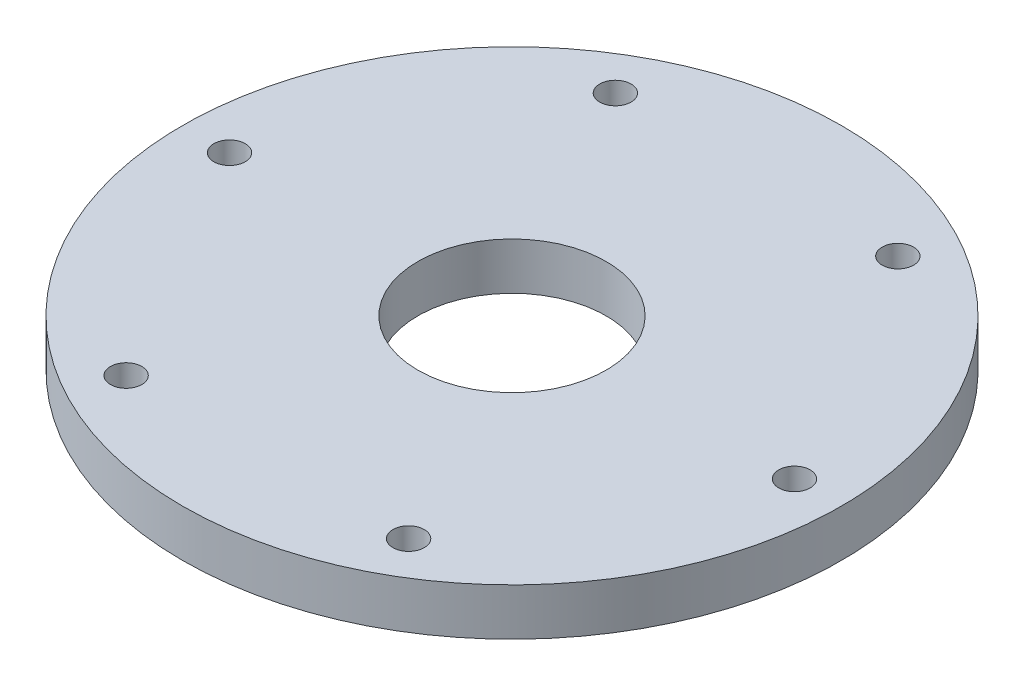
ISO-10303-21;
HEADER;
FILE_DESCRIPTION(('STEP AP214'),'2;1');
FILE_NAME('part.step','',(''),(''),'','','');
FILE_SCHEMA(('AUTOMOTIVE_DESIGN { 1 0 10303 214 1 1 1 1 }'));
ENDSEC;
DATA;
#1=APPLICATION_CONTEXT('core data for automotive mechanical design processes');
#2=APPLICATION_PROTOCOL_DEFINITION('international standard','automotive_design',2000,#1);
#3=PRODUCT_CONTEXT('',#1,'mechanical');
#4=PRODUCT('Part','Part','',(#3));
#5=PRODUCT_RELATED_PRODUCT_CATEGORY('part','',(#4));
#6=PRODUCT_DEFINITION_FORMATION('','',#4);
#7=PRODUCT_DEFINITION_CONTEXT('part definition',#1,'design');
#8=PRODUCT_DEFINITION('design','',#6,#7);
#9=PRODUCT_DEFINITION_SHAPE('','',#8);
#10=(LENGTH_UNIT() NAMED_UNIT(*) SI_UNIT(.MILLI.,.METRE.));
#11=(NAMED_UNIT(*) PLANE_ANGLE_UNIT() SI_UNIT($,.RADIAN.));
#12=(NAMED_UNIT(*) SI_UNIT($,.STERADIAN.) SOLID_ANGLE_UNIT());
#13=UNCERTAINTY_MEASURE_WITH_UNIT(LENGTH_MEASURE(1.E-05),#10,'distance_accuracy_value','');
#14=(GEOMETRIC_REPRESENTATION_CONTEXT(3) GLOBAL_UNCERTAINTY_ASSIGNED_CONTEXT((#13)) GLOBAL_UNIT_ASSIGNED_CONTEXT((#10,
#11,#12)) REPRESENTATION_CONTEXT('',''));
#15=CARTESIAN_POINT('',(0.,0.,0.));
#16=DIRECTION('',(0.,0.,1.));
#17=DIRECTION('',(1.,0.,0.));
#18=AXIS2_PLACEMENT_3D('',#15,#16,#17);
#19=CARTESIAN_POINT('',(0.,0.,0.));
#20=DIRECTION('',(0.,1.,0.));
#21=DIRECTION('',(0.,0.,1.));
#22=AXIS2_PLACEMENT_3D('',#19,#20,#21);
#23=PLANE('',#22);
#24=CARTESIAN_POINT('',(0.,0.,0.));
#25=DIRECTION('',(0.,-1.,0.));
#26=DIRECTION('',(0.,0.,-1.));
#27=AXIS2_PLACEMENT_3D('',#24,#25,#26);
#28=CIRCLE('',#27,41.275);
#29=CARTESIAN_POINT('',(0.,0.,-41.275));
#30=VERTEX_POINT('',#29);
#31=EDGE_CURVE('E73',#30,#30,#28,.T.);
#32=ORIENTED_EDGE('',*,*,#31,.T.);
#33=EDGE_LOOP('',(#32));
#34=FACE_BOUND('',#33,.T.);
#35=CARTESIAN_POINT('',(0.,0.,0.));
#36=DIRECTION('',(0.,1.,0.));
#37=DIRECTION('',(0.,0.,1.));
#38=AXIS2_PLACEMENT_3D('',#35,#36,#37);
#39=CIRCLE('',#38,19.05);
#40=CARTESIAN_POINT('',(0.,0.,19.05));
#41=VERTEX_POINT('',#40);
#42=EDGE_CURVE('E59',#41,#41,#39,.T.);
#43=ORIENTED_EDGE('',*,*,#42,.T.);
#44=EDGE_LOOP('',(#43));
#45=FACE_BOUND('',#44,.T.);
#46=ADVANCED_FACE('F46',(#34,#45),#23,.F.);
#47=CARTESIAN_POINT('',(0.,9.525,0.));
#48=DIRECTION('',(0.,1.,0.));
#49=DIRECTION('',(0.,0.,1.));
#50=AXIS2_PLACEMENT_3D('',#47,#48,#49);
#51=PLANE('',#50);
#52=CARTESIAN_POINT('',(28.5750000000006,9.525,49.4933518262803));
#53=DIRECTION('',(0.,1.,0.));
#54=DIRECTION('',(0.,0.,1.));
#55=AXIS2_PLACEMENT_3D('',#52,#53,#54);
#56=CIRCLE('',#55,3.175);
#57=CARTESIAN_POINT('',(28.5750000000006,9.525,52.6683518262803));
#58=VERTEX_POINT('',#57);
#59=EDGE_CURVE('E109',#58,#58,#56,.T.);
#60=ORIENTED_EDGE('',*,*,#59,.F.);
#61=EDGE_LOOP('',(#60));
#62=FACE_BOUND('',#61,.T.);
#63=CARTESIAN_POINT('',(-28.5749999999995,9.525,49.4933518262809));
#64=DIRECTION('',(0.,1.,0.));
#65=DIRECTION('',(0.,0.,1.));
#66=AXIS2_PLACEMENT_3D('',#63,#64,#65);
#67=CIRCLE('',#66,3.175);
#68=CARTESIAN_POINT('',(-28.5749999999995,9.525,52.6683518262809));
#69=VERTEX_POINT('',#68);
#70=EDGE_CURVE('E103',#69,#69,#67,.T.);
#71=ORIENTED_EDGE('',*,*,#70,.F.);
#72=EDGE_LOOP('',(#71));
#73=FACE_BOUND('',#72,.T.);
#74=CARTESIAN_POINT('',(-57.15,9.525,0.));
#75=DIRECTION('',(0.,1.,0.));
#76=DIRECTION('',(0.,0.,1.));
#77=AXIS2_PLACEMENT_3D('',#74,#75,#76);
#78=CIRCLE('',#77,3.175);
#79=CARTESIAN_POINT('',(-57.15,9.525,3.175));
#80=VERTEX_POINT('',#79);
#81=EDGE_CURVE('E97',#80,#80,#78,.T.);
#82=ORIENTED_EDGE('',*,*,#81,.F.);
#83=EDGE_LOOP('',(#82));
#84=FACE_BOUND('',#83,.T.);
#85=CARTESIAN_POINT('',(-28.5750000000002,9.525,-49.4933518262805));
#86=DIRECTION('',(0.,1.,0.));
#87=DIRECTION('',(0.,0.,1.));
#88=AXIS2_PLACEMENT_3D('',#85,#86,#87);
#89=CIRCLE('',#88,3.175);
#90=CARTESIAN_POINT('',(-28.5750000000002,9.525,-46.3183518262805));
#91=VERTEX_POINT('',#90);
#92=EDGE_CURVE('E91',#91,#91,#89,.T.);
#93=ORIENTED_EDGE('',*,*,#92,.F.);
#94=EDGE_LOOP('',(#93));
#95=FACE_BOUND('',#94,.T.);
#96=CARTESIAN_POINT('',(28.5749999999999,9.525,-49.4933518262807));
#97=DIRECTION('',(0.,1.,0.));
#98=DIRECTION('',(0.,0.,1.));
#99=AXIS2_PLACEMENT_3D('',#96,#97,#98);
#100=CIRCLE('',#99,3.175);
#101=CARTESIAN_POINT('',(28.5749999999999,9.525,-46.3183518262807));
#102=VERTEX_POINT('',#101);
#103=EDGE_CURVE('E85',#102,#102,#100,.T.);
#104=ORIENTED_EDGE('',*,*,#103,.F.);
#105=EDGE_LOOP('',(#104));
#106=FACE_BOUND('',#105,.T.);
#107=CARTESIAN_POINT('',(57.15,9.525,0.));
#108=DIRECTION('',(0.,1.,0.));
#109=DIRECTION('',(0.,0.,1.));
#110=AXIS2_PLACEMENT_3D('',#107,#108,#109);
#111=CIRCLE('',#110,3.175);
#112=CARTESIAN_POINT('',(57.15,9.525,3.175));
#113=VERTEX_POINT('',#112);
#114=EDGE_CURVE('E79',#113,#113,#111,.T.);
#115=ORIENTED_EDGE('',*,*,#114,.F.);
#116=EDGE_LOOP('',(#115));
#117=FACE_BOUND('',#116,.T.);
#118=CARTESIAN_POINT('',(0.,9.525,0.));
#119=DIRECTION('',(0.,1.,0.));
#120=DIRECTION('',(0.,0.,1.));
#121=AXIS2_PLACEMENT_3D('',#118,#119,#120);
#122=CIRCLE('',#121,66.675);
#123=CARTESIAN_POINT('',(0.,9.525,66.675));
#124=VERTEX_POINT('',#123);
#125=EDGE_CURVE('E12',#124,#124,#122,.T.);
#126=ORIENTED_EDGE('',*,*,#125,.T.);
#127=EDGE_LOOP('',(#126));
#128=FACE_BOUND('',#127,.T.);
#129=CARTESIAN_POINT('',(0.,9.525,0.));
#130=DIRECTION('',(0.,1.,0.));
#131=DIRECTION('',(0.,0.,1.));
#132=AXIS2_PLACEMENT_3D('',#129,#130,#131);
#133=CIRCLE('',#132,19.05);
#134=CARTESIAN_POINT('',(0.,9.525,19.05));
#135=VERTEX_POINT('',#134);
#136=EDGE_CURVE('E57',#135,#135,#133,.T.);
#137=ORIENTED_EDGE('',*,*,#136,.F.);
#138=EDGE_LOOP('',(#137));
#139=FACE_BOUND('',#138,.T.);
#140=ADVANCED_FACE('F115',(#62,#73,#84,#95,#106,#117,#128,#139),#51,.T.);
#141=CARTESIAN_POINT('',(28.5750000000006,0.,49.4933518262803));
#142=DIRECTION('',(0.,1.,0.));
#143=DIRECTION('',(0.,0.,1.));
#144=AXIS2_PLACEMENT_3D('',#141,#142,#143);
#145=CIRCLE('',#144,3.175);
#146=CARTESIAN_POINT('',(28.5750000000006,0.,52.6683518262803));
#147=VERTEX_POINT('',#146);
#148=EDGE_CURVE('E106',#147,#147,#145,.T.);
#149=ORIENTED_EDGE('',*,*,#148,.T.);
#150=EDGE_LOOP('',(#149));
#151=FACE_BOUND('',#150,.T.);
#152=CARTESIAN_POINT('',(-28.5749999999995,0.,49.4933518262809));
#153=DIRECTION('',(0.,1.,0.));
#154=DIRECTION('',(0.,0.,1.));
#155=AXIS2_PLACEMENT_3D('',#152,#153,#154);
#156=CIRCLE('',#155,3.175);
#157=CARTESIAN_POINT('',(-28.5749999999995,0.,52.6683518262809));
#158=VERTEX_POINT('',#157);
#159=EDGE_CURVE('E100',#158,#158,#156,.T.);
#160=ORIENTED_EDGE('',*,*,#159,.T.);
#161=EDGE_LOOP('',(#160));
#162=FACE_BOUND('',#161,.T.);
#163=CARTESIAN_POINT('',(-57.15,0.,0.));
#164=DIRECTION('',(0.,1.,0.));
#165=DIRECTION('',(0.,0.,1.));
#166=AXIS2_PLACEMENT_3D('',#163,#164,#165);
#167=CIRCLE('',#166,3.175);
#168=CARTESIAN_POINT('',(-57.15,0.,3.175));
#169=VERTEX_POINT('',#168);
#170=EDGE_CURVE('E94',#169,#169,#167,.T.);
#171=ORIENTED_EDGE('',*,*,#170,.T.);
#172=EDGE_LOOP('',(#171));
#173=FACE_BOUND('',#172,.T.);
#174=CARTESIAN_POINT('',(-28.5750000000002,0.,-49.4933518262805));
#175=DIRECTION('',(0.,1.,0.));
#176=DIRECTION('',(0.,0.,1.));
#177=AXIS2_PLACEMENT_3D('',#174,#175,#176);
#178=CIRCLE('',#177,3.175);
#179=CARTESIAN_POINT('',(-28.5750000000002,0.,-46.3183518262805));
#180=VERTEX_POINT('',#179);
#181=EDGE_CURVE('E88',#180,#180,#178,.T.);
#182=ORIENTED_EDGE('',*,*,#181,.T.);
#183=EDGE_LOOP('',(#182));
#184=FACE_BOUND('',#183,.T.);
#185=CARTESIAN_POINT('',(28.5749999999999,0.,-49.4933518262807));
#186=DIRECTION('',(0.,1.,0.));
#187=DIRECTION('',(0.,0.,1.));
#188=AXIS2_PLACEMENT_3D('',#185,#186,#187);
#189=CIRCLE('',#188,3.175);
#190=CARTESIAN_POINT('',(28.5749999999999,0.,-46.3183518262807));
#191=VERTEX_POINT('',#190);
#192=EDGE_CURVE('E82',#191,#191,#189,.T.);
#193=ORIENTED_EDGE('',*,*,#192,.T.);
#194=EDGE_LOOP('',(#193));
#195=FACE_BOUND('',#194,.T.);
#196=CARTESIAN_POINT('',(57.15,0.,0.));
#197=DIRECTION('',(0.,1.,0.));
#198=DIRECTION('',(0.,0.,1.));
#199=AXIS2_PLACEMENT_3D('',#196,#197,#198);
#200=CIRCLE('',#199,3.175);
#201=CARTESIAN_POINT('',(57.15,0.,3.175));
#202=VERTEX_POINT('',#201);
#203=EDGE_CURVE('E76',#202,#202,#200,.T.);
#204=ORIENTED_EDGE('',*,*,#203,.T.);
#205=EDGE_LOOP('',(#204));
#206=FACE_BOUND('',#205,.T.);
#207=CARTESIAN_POINT('',(0.,0.,0.));
#208=DIRECTION('',(0.,-1.,0.));
#209=DIRECTION('',(0.,0.,-1.));
#210=AXIS2_PLACEMENT_3D('',#207,#208,#209);
#211=CIRCLE('',#210,44.45);
#212=CARTESIAN_POINT('',(0.,0.,-44.45));
#213=VERTEX_POINT('',#212);
#214=EDGE_CURVE('E70',#213,#213,#211,.T.);
#215=ORIENTED_EDGE('',*,*,#214,.F.);
#216=EDGE_LOOP('',(#215));
#217=FACE_BOUND('',#216,.T.);
#218=CARTESIAN_POINT('',(0.,0.,0.));
#219=DIRECTION('',(0.,1.,0.));
#220=DIRECTION('',(0.,0.,1.));
#221=AXIS2_PLACEMENT_3D('',#218,#219,#220);
#222=CIRCLE('',#221,66.675);
#223=CARTESIAN_POINT('',(0.,0.,66.675));
#224=VERTEX_POINT('',#223);
#225=EDGE_CURVE('E50',#224,#224,#222,.T.);
#226=ORIENTED_EDGE('',*,*,#225,.F.);
#227=EDGE_LOOP('',(#226));
#228=FACE_BOUND('',#227,.T.);
#229=ADVANCED_FACE('F118',(#151,#162,#173,#184,#195,#206,#217,#228),#23,.F.);
#230=CARTESIAN_POINT('',(0.,9.525,0.));
#231=DIRECTION('',(0.,-1.,0.));
#232=DIRECTION('',(0.,0.,-1.));
#233=AXIS2_PLACEMENT_3D('',#230,#231,#232);
#234=CYLINDRICAL_SURFACE('',#233,66.675);
#235=ORIENTED_EDGE('',*,*,#125,.F.);
#236=EDGE_LOOP('',(#235));
#237=FACE_BOUND('',#236,.T.);
#238=ORIENTED_EDGE('',*,*,#225,.T.);
#239=EDGE_LOOP('',(#238));
#240=FACE_BOUND('',#239,.T.);
#241=ADVANCED_FACE('F48',(#237,#240),#234,.T.);
#242=CARTESIAN_POINT('',(0.,9.525,0.));
#243=DIRECTION('',(0.,-1.,0.));
#244=DIRECTION('',(0.,0.,-1.));
#245=AXIS2_PLACEMENT_3D('',#242,#243,#244);
#246=CYLINDRICAL_SURFACE('',#245,19.05);
#247=ORIENTED_EDGE('',*,*,#136,.T.);
#248=EDGE_LOOP('',(#247));
#249=FACE_BOUND('',#248,.T.);
#250=ORIENTED_EDGE('',*,*,#42,.F.);
#251=EDGE_LOOP('',(#250));
#252=FACE_BOUND('',#251,.T.);
#253=ADVANCED_FACE('F132',(#249,#252),#246,.F.);
#254=CARTESIAN_POINT('',(0.,-0.47625,0.));
#255=DIRECTION('',(0.,-1.,0.));
#256=DIRECTION('',(0.,0.,-1.));
#257=AXIS2_PLACEMENT_3D('',#254,#255,#256);
#258=CYLINDRICAL_SURFACE('',#257,41.275);
#259=ORIENTED_EDGE('',*,*,#31,.F.);
#260=EDGE_LOOP('',(#259));
#261=FACE_BOUND('',#260,.T.);
#262=CARTESIAN_POINT('',(0.,3.81,0.));
#263=DIRECTION('',(0.,-1.,0.));
#264=DIRECTION('',(0.,0.,-1.));
#265=AXIS2_PLACEMENT_3D('',#262,#263,#264);
#266=CIRCLE('',#265,41.275);
#267=CARTESIAN_POINT('',(0.,3.81,-41.275));
#268=VERTEX_POINT('',#267);
#269=EDGE_CURVE('E62',#268,#268,#266,.T.);
#270=ORIENTED_EDGE('',*,*,#269,.T.);
#271=EDGE_LOOP('',(#270));
#272=FACE_BOUND('',#271,.T.);
#273=ADVANCED_FACE('F135',(#261,#272),#258,.T.);
#274=CARTESIAN_POINT('',(41.275,3.81,0.));
#275=DIRECTION('',(0.,1.,0.));
#276=DIRECTION('',(0.,0.,1.));
#277=AXIS2_PLACEMENT_3D('',#274,#275,#276);
#278=PLANE('',#277);
#279=ORIENTED_EDGE('',*,*,#269,.F.);
#280=EDGE_LOOP('',(#279));
#281=FACE_BOUND('',#280,.T.);
#282=CARTESIAN_POINT('',(0.,3.81,0.));
#283=DIRECTION('',(0.,-1.,0.));
#284=DIRECTION('',(0.,0.,-1.));
#285=AXIS2_PLACEMENT_3D('',#282,#283,#284);
#286=CIRCLE('',#285,44.45);
#287=CARTESIAN_POINT('',(0.,3.81,-44.45));
#288=VERTEX_POINT('',#287);
#289=EDGE_CURVE('E67',#288,#288,#286,.T.);
#290=ORIENTED_EDGE('',*,*,#289,.T.);
#291=EDGE_LOOP('',(#290));
#292=FACE_BOUND('',#291,.T.);
#293=ADVANCED_FACE('F169',(#281,#292),#278,.F.);
#294=CARTESIAN_POINT('',(0.,-0.47625,0.));
#295=DIRECTION('',(0.,-1.,0.));
#296=DIRECTION('',(0.,0.,-1.));
#297=AXIS2_PLACEMENT_3D('',#294,#295,#296);
#298=CYLINDRICAL_SURFACE('',#297,44.45);
#299=ORIENTED_EDGE('',*,*,#289,.F.);
#300=EDGE_LOOP('',(#299));
#301=FACE_BOUND('',#300,.T.);
#302=ORIENTED_EDGE('',*,*,#214,.T.);
#303=EDGE_LOOP('',(#302));
#304=FACE_BOUND('',#303,.T.);
#305=ADVANCED_FACE('F166',(#301,#304),#298,.F.);
#306=CARTESIAN_POINT('',(57.15,9.525,0.));
#307=DIRECTION('',(0.,1.,0.));
#308=DIRECTION('',(0.,0.,1.));
#309=AXIS2_PLACEMENT_3D('',#306,#307,#308);
#310=CYLINDRICAL_SURFACE('',#309,3.175);
#311=ORIENTED_EDGE('',*,*,#203,.F.);
#312=EDGE_LOOP('',(#311));
#313=FACE_BOUND('',#312,.T.);
#314=ORIENTED_EDGE('',*,*,#114,.T.);
#315=EDGE_LOOP('',(#314));
#316=FACE_BOUND('',#315,.T.);
#317=ADVANCED_FACE('F168',(#313,#316),#310,.F.);
#318=CARTESIAN_POINT('',(28.5749999999999,9.525,-49.4933518262807));
#319=DIRECTION('',(0.,1.,0.));
#320=DIRECTION('',(0.,0.,1.));
#321=AXIS2_PLACEMENT_3D('',#318,#319,#320);
#322=CYLINDRICAL_SURFACE('',#321,3.175);
#323=ORIENTED_EDGE('',*,*,#192,.F.);
#324=EDGE_LOOP('',(#323));
#325=FACE_BOUND('',#324,.T.);
#326=ORIENTED_EDGE('',*,*,#103,.T.);
#327=EDGE_LOOP('',(#326));
#328=FACE_BOUND('',#327,.T.);
#329=ADVANCED_FACE('F176',(#325,#328),#322,.F.);
#330=CARTESIAN_POINT('',(-28.5750000000002,9.525,-49.4933518262805));
#331=DIRECTION('',(0.,1.,0.));
#332=DIRECTION('',(0.,0.,1.));
#333=AXIS2_PLACEMENT_3D('',#330,#331,#332);
#334=CYLINDRICAL_SURFACE('',#333,3.175);
#335=ORIENTED_EDGE('',*,*,#181,.F.);
#336=EDGE_LOOP('',(#335));
#337=FACE_BOUND('',#336,.T.);
#338=ORIENTED_EDGE('',*,*,#92,.T.);
#339=EDGE_LOOP('',(#338));
#340=FACE_BOUND('',#339,.T.);
#341=ADVANCED_FACE('F230',(#337,#340),#334,.F.);
#342=CARTESIAN_POINT('',(-57.15,9.525,0.));
#343=DIRECTION('',(0.,1.,0.));
#344=DIRECTION('',(0.,0.,1.));
#345=AXIS2_PLACEMENT_3D('',#342,#343,#344);
#346=CYLINDRICAL_SURFACE('',#345,3.175);
#347=ORIENTED_EDGE('',*,*,#170,.F.);
#348=EDGE_LOOP('',(#347));
#349=FACE_BOUND('',#348,.T.);
#350=ORIENTED_EDGE('',*,*,#81,.T.);
#351=EDGE_LOOP('',(#350));
#352=FACE_BOUND('',#351,.T.);
#353=ADVANCED_FACE('F240',(#349,#352),#346,.F.);
#354=CARTESIAN_POINT('',(-28.5749999999995,9.525,49.4933518262809));
#355=DIRECTION('',(0.,1.,0.));
#356=DIRECTION('',(0.,0.,1.));
#357=AXIS2_PLACEMENT_3D('',#354,#355,#356);
#358=CYLINDRICAL_SURFACE('',#357,3.175);
#359=ORIENTED_EDGE('',*,*,#159,.F.);
#360=EDGE_LOOP('',(#359));
#361=FACE_BOUND('',#360,.T.);
#362=ORIENTED_EDGE('',*,*,#70,.T.);
#363=EDGE_LOOP('',(#362));
#364=FACE_BOUND('',#363,.T.);
#365=ADVANCED_FACE('F251',(#361,#364),#358,.F.);
#366=CARTESIAN_POINT('',(28.5750000000006,9.525,49.4933518262803));
#367=DIRECTION('',(0.,1.,0.));
#368=DIRECTION('',(0.,0.,1.));
#369=AXIS2_PLACEMENT_3D('',#366,#367,#368);
#370=CYLINDRICAL_SURFACE('',#369,3.175);
#371=ORIENTED_EDGE('',*,*,#148,.F.);
#372=EDGE_LOOP('',(#371));
#373=FACE_BOUND('',#372,.T.);
#374=ORIENTED_EDGE('',*,*,#59,.T.);
#375=EDGE_LOOP('',(#374));
#376=FACE_BOUND('',#375,.T.);
#377=ADVANCED_FACE('F113',(#373,#376),#370,.F.);
#378=CLOSED_SHELL('',(#46,#140,#229,#241,#253,#273,#293,#305,#317,#329,#341,#353,#365,#377));
#379=MANIFOLD_SOLID_BREP('B2',#378);
#380=ADVANCED_BREP_SHAPE_REPRESENTATION('',(#18,#379),#14);
#381=SHAPE_DEFINITION_REPRESENTATION(#9,#380);
ENDSEC;
END-ISO-10303-21;
